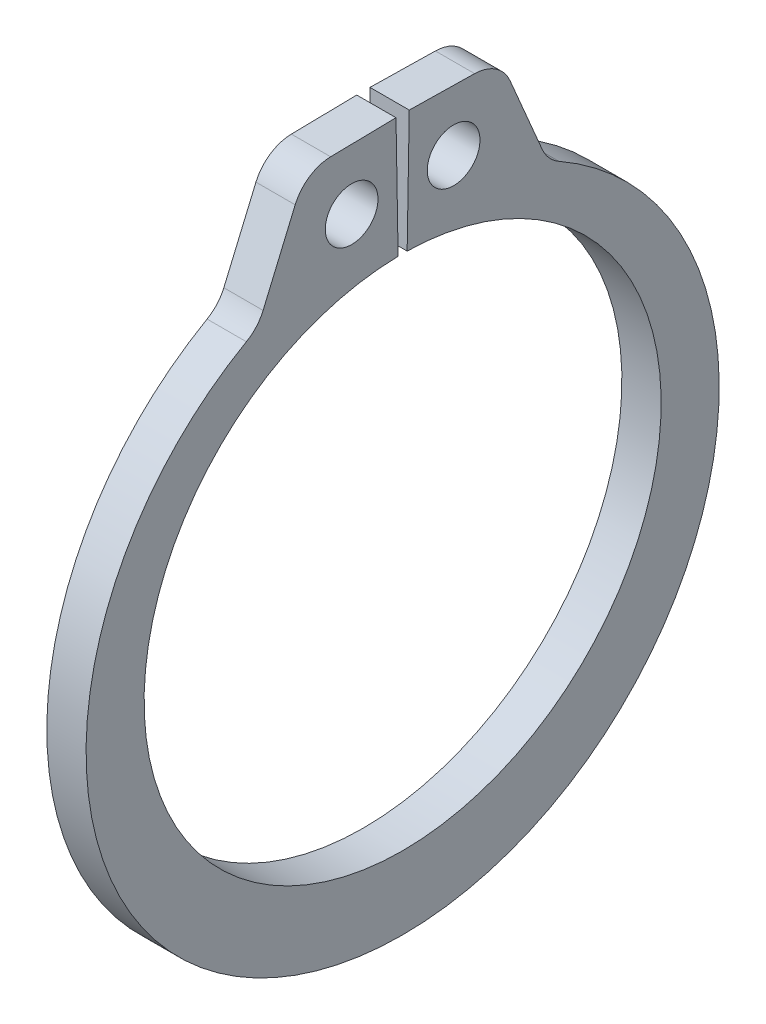
ISO-10303-21;
HEADER;
FILE_DESCRIPTION(('STEP AP214'),'2;1');
FILE_NAME('part.step','',(''),(''),'','','');
FILE_SCHEMA(('AUTOMOTIVE_DESIGN { 1 0 10303 214 1 1 1 1 }'));
ENDSEC;
DATA;
#1=APPLICATION_CONTEXT('core data for automotive mechanical design processes');
#2=APPLICATION_PROTOCOL_DEFINITION('international standard','automotive_design',2000,#1);
#3=PRODUCT_CONTEXT('',#1,'mechanical');
#4=PRODUCT('Part','Part','',(#3));
#5=PRODUCT_RELATED_PRODUCT_CATEGORY('part','',(#4));
#6=PRODUCT_DEFINITION_FORMATION('','',#4);
#7=PRODUCT_DEFINITION_CONTEXT('part definition',#1,'design');
#8=PRODUCT_DEFINITION('design','',#6,#7);
#9=PRODUCT_DEFINITION_SHAPE('','',#8);
#10=(LENGTH_UNIT() NAMED_UNIT(*) SI_UNIT(.MILLI.,.METRE.));
#11=(NAMED_UNIT(*) PLANE_ANGLE_UNIT() SI_UNIT($,.RADIAN.));
#12=(NAMED_UNIT(*) SI_UNIT($,.STERADIAN.) SOLID_ANGLE_UNIT());
#13=UNCERTAINTY_MEASURE_WITH_UNIT(LENGTH_MEASURE(1.E-05),#10,'distance_accuracy_value','');
#14=(GEOMETRIC_REPRESENTATION_CONTEXT(3) GLOBAL_UNCERTAINTY_ASSIGNED_CONTEXT((#13)) GLOBAL_UNIT_ASSIGNED_CONTEXT((#10,
#11,#12)) REPRESENTATION_CONTEXT('',''));
#15=CARTESIAN_POINT('',(0.,0.,0.));
#16=DIRECTION('',(0.,0.,1.));
#17=DIRECTION('',(1.,0.,0.));
#18=AXIS2_PLACEMENT_3D('',#15,#16,#17);
#19=CARTESIAN_POINT('',(0.4445,0.,0.));
#20=DIRECTION('',(1.,0.,0.));
#21=DIRECTION('',(0.,0.,-1.));
#22=AXIS2_PLACEMENT_3D('',#19,#20,#21);
#23=PLANE('',#22);
#24=CARTESIAN_POINT('',(0.4445,7.20724610900659,-1.15465964864512));
#25=DIRECTION('',(-1.,0.,0.));
#26=DIRECTION('',(0.,0.,1.));
#27=AXIS2_PLACEMENT_3D('',#24,#25,#26);
#28=CIRCLE('',#27,0.5969);
#29=CARTESIAN_POINT('',(0.4445,7.20724610900659,-0.557759648645121));
#30=VERTEX_POINT('',#29);
#31=EDGE_CURVE('E105',#30,#30,#28,.T.);
#32=ORIENTED_EDGE('',*,*,#31,.T.);
#33=EDGE_LOOP('',(#32));
#34=FACE_BOUND('',#33,.T.);
#35=CARTESIAN_POINT('',(0.4445,0.,0.));
#36=DIRECTION('',(-1.,0.,0.));
#37=DIRECTION('',(0.,0.,1.));
#38=AXIS2_PLACEMENT_3D('',#35,#36,#37);
#39=CIRCLE('',#38,5.8547);
#40=CARTESIAN_POINT('',(0.4445,5.85380830083212,-0.102178603968365));
#41=VERTEX_POINT('',#40);
#42=CARTESIAN_POINT('',(0.4445,5.85380830083212,0.102178603968364));
#43=VERTEX_POINT('',#42);
#44=EDGE_CURVE('E163',#41,#43,#39,.T.);
#45=ORIENTED_EDGE('',*,*,#44,.T.);
#46=DIRECTION('',(0.,-0.999847695156391,-0.0174524064372836));
#47=VECTOR('',#46,1.);
#48=CARTESIAN_POINT('',(0.4445,5.85380830083212,0.102178603968364));
#49=LINE('',#48,#47);
#50=CARTESIAN_POINT('',(0.4445,8.59659049818514,0.150054045307121));
#51=VERTEX_POINT('',#50);
#52=EDGE_CURVE('E119',#43,#51,#49,.F.);
#53=ORIENTED_EDGE('',*,*,#52,.T.);
#54=DIRECTION('',(0.,0.0174524064372841,-0.999847695156391));
#55=VECTOR('',#54,1.);
#56=CARTESIAN_POINT('',(0.4445,8.59659049818514,0.150054045307121));
#57=LINE('',#56,#55);
#58=CARTESIAN_POINT('',(0.4445,8.57074959100772,1.63047862600547));
#59=VERTEX_POINT('',#58);
#60=EDGE_CURVE('E116',#51,#59,#57,.F.);
#61=ORIENTED_EDGE('',*,*,#60,.T.);
#62=CARTESIAN_POINT('',(0.4445,7.68188499001369,1.61496343668273));
#63=DIRECTION('',(-1.,0.,0.));
#64=DIRECTION('',(0.,0.,1.));
#65=AXIS2_PLACEMENT_3D('',#62,#63,#64);
#66=CIRCLE('',#65,0.889);
#67=CARTESIAN_POINT('',(0.4445,8.02998759243226,2.43297662617873));
#68=VERTEX_POINT('',#67);
#69=EDGE_CURVE('E109',#68,#59,#66,.T.);
#70=ORIENTED_EDGE('',*,*,#69,.F.);
#71=DIRECTION('',(0.,0.920149819455567,-0.391566481910655));
#72=VECTOR('',#71,1.);
#73=CARTESIAN_POINT('',(0.4445,8.56068391718107,2.20714069332188));
#74=LINE('',#73,#72);
#75=CARTESIAN_POINT('',(0.4445,6.32221463110736,3.15971333386378));
#76=VERTEX_POINT('',#75);
#77=EDGE_CURVE('E104',#68,#76,#74,.F.);
#78=ORIENTED_EDGE('',*,*,#77,.T.);
#79=CARTESIAN_POINT('',(0.4445,6.67031723352593,3.97772652335978));
#80=DIRECTION('',(-1.,0.,0.));
#81=DIRECTION('',(0.,0.,1.));
#82=AXIS2_PLACEMENT_3D('',#79,#80,#81);
#83=CIRCLE('',#82,0.889);
#84=CARTESIAN_POINT('',(0.4445,5.89719335877508,3.53886381784672));
#85=VERTEX_POINT('',#84);
#86=EDGE_CURVE('E95',#76,#85,#83,.T.);
#87=ORIENTED_EDGE('',*,*,#86,.T.);
#88=CARTESIAN_POINT('',(0.4445,-0.337057291142251,0.));
#89=DIRECTION('',(-1.,0.,0.));
#90=DIRECTION('',(0.,0.,1.));
#91=AXIS2_PLACEMENT_3D('',#88,#89,#90);
#92=CIRCLE('',#91,7.16864270885775);
#93=CARTESIAN_POINT('',(0.4445,5.89719335877508,-3.53886381784672));
#94=VERTEX_POINT('',#93);
#95=EDGE_CURVE('E170',#94,#85,#92,.T.);
#96=ORIENTED_EDGE('',*,*,#95,.F.);
#97=CARTESIAN_POINT('',(0.4445,6.67031723352593,-3.97772652335978));
#98=DIRECTION('',(-1.,0.,0.));
#99=DIRECTION('',(0.,0.,1.));
#100=AXIS2_PLACEMENT_3D('',#97,#98,#99);
#101=CIRCLE('',#100,0.889);
#102=CARTESIAN_POINT('',(0.4445,6.32221463110736,-3.15971333386378));
#103=VERTEX_POINT('',#102);
#104=EDGE_CURVE('E167',#94,#103,#101,.T.);
#105=ORIENTED_EDGE('',*,*,#104,.T.);
#106=DIRECTION('',(0.,-0.920149819455567,-0.391566481910655));
#107=VECTOR('',#106,1.);
#108=CARTESIAN_POINT('',(0.4445,8.56068391718107,-2.20714069332188));
#109=LINE('',#108,#107);
#110=CARTESIAN_POINT('',(0.4445,8.02998759243226,-2.43297662617873));
#111=VERTEX_POINT('',#110);
#112=EDGE_CURVE('E132',#103,#111,#109,.F.);
#113=ORIENTED_EDGE('',*,*,#112,.T.);
#114=CARTESIAN_POINT('',(0.4445,7.68188499001369,-1.61496343668273));
#115=DIRECTION('',(-1.,0.,0.));
#116=DIRECTION('',(0.,0.,1.));
#117=AXIS2_PLACEMENT_3D('',#114,#115,#116);
#118=CIRCLE('',#117,0.889);
#119=CARTESIAN_POINT('',(0.4445,8.57074959100772,-1.63047862600547));
#120=VERTEX_POINT('',#119);
#121=EDGE_CURVE('E134',#120,#111,#118,.T.);
#122=ORIENTED_EDGE('',*,*,#121,.F.);
#123=DIRECTION('',(0.,-0.0174524064372841,-0.999847695156391));
#124=VECTOR('',#123,1.);
#125=CARTESIAN_POINT('',(0.4445,8.59659049818514,-0.150054045307121));
#126=LINE('',#125,#124);
#127=CARTESIAN_POINT('',(0.4445,8.59659049818514,-0.150054045307121));
#128=VERTEX_POINT('',#127);
#129=EDGE_CURVE('E128',#120,#128,#126,.F.);
#130=ORIENTED_EDGE('',*,*,#129,.T.);
#131=DIRECTION('',(0.,0.999847695156391,-0.0174524064372836));
#132=VECTOR('',#131,1.);
#133=CARTESIAN_POINT('',(0.4445,5.85380830083212,-0.102178603968364));
#134=LINE('',#133,#132);
#135=EDGE_CURVE('E123',#128,#41,#134,.F.);
#136=ORIENTED_EDGE('',*,*,#135,.T.);
#137=EDGE_LOOP('',(#45,#53,#61,#70,#78,#87,#96,#105,#113,#122,#130,#136));
#138=FACE_BOUND('',#137,.T.);
#139=CARTESIAN_POINT('',(0.4445,7.20724610900659,1.15465964864512));
#140=DIRECTION('',(-1.,0.,0.));
#141=DIRECTION('',(0.,0.,1.));
#142=AXIS2_PLACEMENT_3D('',#139,#140,#141);
#143=CIRCLE('',#142,0.5969);
#144=CARTESIAN_POINT('',(0.4445,7.20724610900659,1.75155964864512));
#145=VERTEX_POINT('',#144);
#146=EDGE_CURVE('E17',#145,#145,#143,.T.);
#147=ORIENTED_EDGE('',*,*,#146,.T.);
#148=EDGE_LOOP('',(#147));
#149=FACE_BOUND('',#148,.T.);
#150=ADVANCED_FACE('F14',(#34,#138,#149),#23,.T.);
#151=CARTESIAN_POINT('',(0.4445,7.20724610900659,1.15465964864512));
#152=DIRECTION('',(-1.,0.,0.));
#153=DIRECTION('',(0.,0.,1.));
#154=AXIS2_PLACEMENT_3D('',#151,#152,#153);
#155=CYLINDRICAL_SURFACE('',#154,0.5969);
#156=CARTESIAN_POINT('',(-0.4445,7.20724610900659,1.15465964864512));
#157=DIRECTION('',(-1.,0.,0.));
#158=DIRECTION('',(0.,0.,1.));
#159=AXIS2_PLACEMENT_3D('',#156,#157,#158);
#160=CIRCLE('',#159,0.5969);
#161=CARTESIAN_POINT('',(-0.4445,7.20724610900659,1.75155964864512));
#162=VERTEX_POINT('',#161);
#163=EDGE_CURVE('E157',#162,#162,#160,.T.);
#164=ORIENTED_EDGE('',*,*,#163,.T.);
#165=EDGE_LOOP('',(#164));
#166=FACE_BOUND('',#165,.T.);
#167=ORIENTED_EDGE('',*,*,#146,.F.);
#168=EDGE_LOOP('',(#167));
#169=FACE_BOUND('',#168,.T.);
#170=ADVANCED_FACE('F365',(#166,#169),#155,.F.);
#171=CARTESIAN_POINT('',(0.4445,6.67031723352593,3.97772652335978));
#172=DIRECTION('',(-1.,0.,0.));
#173=DIRECTION('',(0.,0.,1.));
#174=AXIS2_PLACEMENT_3D('',#171,#172,#173);
#175=CYLINDRICAL_SURFACE('',#174,0.889);
#176=DIRECTION('',(1.,0.,0.));
#177=VECTOR('',#176,1.);
#178=CARTESIAN_POINT('',(0.4445,6.32221463110736,3.15971333386378));
#179=LINE('',#178,#177);
#180=CARTESIAN_POINT('',(-0.4445,6.32221463110736,3.15971333386378));
#181=VERTEX_POINT('',#180);
#182=EDGE_CURVE('E99',#76,#181,#179,.F.);
#183=ORIENTED_EDGE('',*,*,#182,.T.);
#184=CARTESIAN_POINT('',(-0.4445,6.67031723352593,3.97772652335978));
#185=DIRECTION('',(-1.,0.,0.));
#186=DIRECTION('',(0.,0.,1.));
#187=AXIS2_PLACEMENT_3D('',#184,#185,#186);
#188=CIRCLE('',#187,0.889);
#189=CARTESIAN_POINT('',(-0.4445,5.89719335877508,3.53886381784672));
#190=VERTEX_POINT('',#189);
#191=EDGE_CURVE('E155',#181,#190,#188,.T.);
#192=ORIENTED_EDGE('',*,*,#191,.T.);
#193=DIRECTION('',(-1.,0.,0.));
#194=VECTOR('',#193,1.);
#195=CARTESIAN_POINT('',(0.4445,5.89719335877508,3.53886381784672));
#196=LINE('',#195,#194);
#197=EDGE_CURVE('E100',#85,#190,#196,.T.);
#198=ORIENTED_EDGE('',*,*,#197,.F.);
#199=ORIENTED_EDGE('',*,*,#86,.F.);
#200=EDGE_LOOP('',(#183,#192,#198,#199));
#201=FACE_BOUND('',#200,.T.);
#202=ADVANCED_FACE('F97',(#201),#175,.F.);
#203=CARTESIAN_POINT('',(0.4445,-0.337057291142251,0.));
#204=DIRECTION('',(-1.,0.,0.));
#205=DIRECTION('',(0.,0.,1.));
#206=AXIS2_PLACEMENT_3D('',#203,#204,#205);
#207=CYLINDRICAL_SURFACE('',#206,7.16864270885775);
#208=CARTESIAN_POINT('',(-0.4445,-0.337057291142251,0.));
#209=DIRECTION('',(-1.,0.,0.));
#210=DIRECTION('',(0.,0.,1.));
#211=AXIS2_PLACEMENT_3D('',#208,#209,#210);
#212=CIRCLE('',#211,7.16864270885775);
#213=CARTESIAN_POINT('',(-0.4445,5.89719335877508,-3.53886381784672));
#214=VERTEX_POINT('',#213);
#215=EDGE_CURVE('E153',#190,#214,#212,.F.);
#216=ORIENTED_EDGE('',*,*,#215,.T.);
#217=DIRECTION('',(-1.,0.,0.));
#218=VECTOR('',#217,1.);
#219=CARTESIAN_POINT('',(0.4445,5.89719335877508,-3.53886381784672));
#220=LINE('',#219,#218);
#221=EDGE_CURVE('E169',#214,#94,#220,.F.);
#222=ORIENTED_EDGE('',*,*,#221,.T.);
#223=ORIENTED_EDGE('',*,*,#95,.T.);
#224=ORIENTED_EDGE('',*,*,#197,.T.);
#225=EDGE_LOOP('',(#216,#222,#223,#224));
#226=FACE_BOUND('',#225,.T.);
#227=ADVANCED_FACE('F175',(#226),#207,.T.);
#228=CARTESIAN_POINT('',(0.4445,6.67031723352593,-3.97772652335978));
#229=DIRECTION('',(-1.,0.,0.));
#230=DIRECTION('',(0.,0.,1.));
#231=AXIS2_PLACEMENT_3D('',#228,#229,#230);
#232=CYLINDRICAL_SURFACE('',#231,0.889);
#233=ORIENTED_EDGE('',*,*,#221,.F.);
#234=CARTESIAN_POINT('',(-0.4445,6.67031723352593,-3.97772652335978));
#235=DIRECTION('',(-1.,0.,0.));
#236=DIRECTION('',(0.,0.,1.));
#237=AXIS2_PLACEMENT_3D('',#234,#235,#236);
#238=CIRCLE('',#237,0.889);
#239=CARTESIAN_POINT('',(-0.4445,6.32221463110736,-3.15971333386378));
#240=VERTEX_POINT('',#239);
#241=EDGE_CURVE('E150',#214,#240,#238,.T.);
#242=ORIENTED_EDGE('',*,*,#241,.T.);
#243=DIRECTION('',(1.,0.,0.));
#244=VECTOR('',#243,1.);
#245=CARTESIAN_POINT('',(0.4445,6.32221463110736,-3.15971333386378));
#246=LINE('',#245,#244);
#247=EDGE_CURVE('E135',#240,#103,#246,.T.);
#248=ORIENTED_EDGE('',*,*,#247,.T.);
#249=ORIENTED_EDGE('',*,*,#104,.F.);
#250=EDGE_LOOP('',(#233,#242,#248,#249));
#251=FACE_BOUND('',#250,.T.);
#252=ADVANCED_FACE('F187',(#251),#232,.F.);
#253=CARTESIAN_POINT('',(0.4445,8.56068391718107,-2.20714069332188));
#254=DIRECTION('',(0.,-0.391566481910655,0.920149819455567));
#255=DIRECTION('',(0.,-0.920149819455567,-0.391566481910655));
#256=AXIS2_PLACEMENT_3D('',#253,#254,#255);
#257=PLANE('',#256);
#258=ORIENTED_EDGE('',*,*,#247,.F.);
#259=DIRECTION('',(0.,0.920149819455567,0.391566481910655));
#260=VECTOR('',#259,1.);
#261=CARTESIAN_POINT('',(-0.4445,6.32221463110736,-3.15971333386378));
#262=LINE('',#261,#260);
#263=CARTESIAN_POINT('',(-0.4445,8.02998759243226,-2.43297662617873));
#264=VERTEX_POINT('',#263);
#265=EDGE_CURVE('E149',#240,#264,#262,.T.);
#266=ORIENTED_EDGE('',*,*,#265,.T.);
#267=DIRECTION('',(-1.,0.,0.));
#268=VECTOR('',#267,1.);
#269=CARTESIAN_POINT('',(0.4445,8.02998759243226,-2.43297662617873));
#270=LINE('',#269,#268);
#271=EDGE_CURVE('E166',#111,#264,#270,.T.);
#272=ORIENTED_EDGE('',*,*,#271,.F.);
#273=ORIENTED_EDGE('',*,*,#112,.F.);
#274=EDGE_LOOP('',(#258,#266,#272,#273));
#275=FACE_BOUND('',#274,.T.);
#276=ADVANCED_FACE('F192',(#275),#257,.F.);
#277=CARTESIAN_POINT('',(0.4445,7.68188499001369,-1.61496343668273));
#278=DIRECTION('',(-1.,0.,0.));
#279=DIRECTION('',(0.,0.,1.));
#280=AXIS2_PLACEMENT_3D('',#277,#278,#279);
#281=CYLINDRICAL_SURFACE('',#280,0.889);
#282=CARTESIAN_POINT('',(-0.4445,7.68188499001369,-1.61496343668273));
#283=DIRECTION('',(-1.,0.,0.));
#284=DIRECTION('',(0.,0.,1.));
#285=AXIS2_PLACEMENT_3D('',#282,#283,#284);
#286=CIRCLE('',#285,0.889);
#287=CARTESIAN_POINT('',(-0.4445,8.57074959100772,-1.63047862600547));
#288=VERTEX_POINT('',#287);
#289=EDGE_CURVE('E145',#264,#288,#286,.F.);
#290=ORIENTED_EDGE('',*,*,#289,.T.);
#291=DIRECTION('',(1.,0.,0.));
#292=VECTOR('',#291,1.);
#293=CARTESIAN_POINT('',(0.4445,8.57074959100772,-1.63047862600547));
#294=LINE('',#293,#292);
#295=EDGE_CURVE('E131',#288,#120,#294,.T.);
#296=ORIENTED_EDGE('',*,*,#295,.T.);
#297=ORIENTED_EDGE('',*,*,#121,.T.);
#298=ORIENTED_EDGE('',*,*,#271,.T.);
#299=EDGE_LOOP('',(#290,#296,#297,#298));
#300=FACE_BOUND('',#299,.T.);
#301=ADVANCED_FACE('F243',(#300),#281,.T.);
#302=CARTESIAN_POINT('',(0.4445,8.59659049818514,-0.150054045307121));
#303=DIRECTION('',(0.,-0.999847695156391,0.0174524064372841));
#304=DIRECTION('',(0.,-0.0174524064372841,-0.999847695156391));
#305=AXIS2_PLACEMENT_3D('',#302,#303,#304);
#306=PLANE('',#305);
#307=ORIENTED_EDGE('',*,*,#295,.F.);
#308=DIRECTION('',(0.,0.0174524064372836,0.999847695156391));
#309=VECTOR('',#308,1.);
#310=CARTESIAN_POINT('',(-0.4445,8.57074959100772,-1.63047862600547));
#311=LINE('',#310,#309);
#312=CARTESIAN_POINT('',(-0.4445,8.59659049818514,-0.150054045307121));
#313=VERTEX_POINT('',#312);
#314=EDGE_CURVE('E148',#288,#313,#311,.T.);
#315=ORIENTED_EDGE('',*,*,#314,.T.);
#316=DIRECTION('',(1.,0.,0.));
#317=VECTOR('',#316,1.);
#318=CARTESIAN_POINT('',(0.4445,8.59659049818514,-0.150054045307121));
#319=LINE('',#318,#317);
#320=EDGE_CURVE('E127',#313,#128,#319,.T.);
#321=ORIENTED_EDGE('',*,*,#320,.T.);
#322=ORIENTED_EDGE('',*,*,#129,.F.);
#323=EDGE_LOOP('',(#307,#315,#321,#322));
#324=FACE_BOUND('',#323,.T.);
#325=ADVANCED_FACE('F241',(#324),#306,.F.);
#326=CARTESIAN_POINT('',(0.4445,5.85380830083212,-0.102178603968364));
#327=DIRECTION('',(0.,-0.0174524064372836,-0.999847695156391));
#328=DIRECTION('',(0.,0.999847695156391,-0.0174524064372836));
#329=AXIS2_PLACEMENT_3D('',#326,#327,#328);
#330=PLANE('',#329);
#331=DIRECTION('',(-1.,0.,0.));
#332=VECTOR('',#331,1.);
#333=CARTESIAN_POINT('',(0.4445,5.85380830083212,-0.102178603968365));
#334=LINE('',#333,#332);
#335=CARTESIAN_POINT('',(-0.4445,5.85380830083212,-0.102178603968365));
#336=VERTEX_POINT('',#335);
#337=EDGE_CURVE('E126',#336,#41,#334,.F.);
#338=ORIENTED_EDGE('',*,*,#337,.T.);
#339=ORIENTED_EDGE('',*,*,#135,.F.);
#340=ORIENTED_EDGE('',*,*,#320,.F.);
#341=DIRECTION('',(0.,-0.999847695156391,0.0174524064372836));
#342=VECTOR('',#341,1.);
#343=CARTESIAN_POINT('',(-0.4445,8.59659049818514,-0.150054045307121));
#344=LINE('',#343,#342);
#345=EDGE_CURVE('E144',#313,#336,#344,.T.);
#346=ORIENTED_EDGE('',*,*,#345,.T.);
#347=EDGE_LOOP('',(#338,#339,#340,#346));
#348=FACE_BOUND('',#347,.T.);
#349=ADVANCED_FACE('F236',(#348),#330,.F.);
#350=CARTESIAN_POINT('',(0.4445,0.,0.));
#351=DIRECTION('',(-1.,0.,0.));
#352=DIRECTION('',(0.,0.,1.));
#353=AXIS2_PLACEMENT_3D('',#350,#351,#352);
#354=CYLINDRICAL_SURFACE('',#353,5.8547);
#355=ORIENTED_EDGE('',*,*,#44,.F.);
#356=ORIENTED_EDGE('',*,*,#337,.F.);
#357=CARTESIAN_POINT('',(-0.4445,0.,0.));
#358=DIRECTION('',(-1.,0.,0.));
#359=DIRECTION('',(0.,0.,1.));
#360=AXIS2_PLACEMENT_3D('',#357,#358,#359);
#361=CIRCLE('',#360,5.8547);
#362=CARTESIAN_POINT('',(-0.4445,5.85380830083212,0.102178603968364));
#363=VERTEX_POINT('',#362);
#364=EDGE_CURVE('E141',#336,#363,#361,.T.);
#365=ORIENTED_EDGE('',*,*,#364,.T.);
#366=DIRECTION('',(1.,0.,0.));
#367=VECTOR('',#366,1.);
#368=CARTESIAN_POINT('',(0.4445,5.85380830083212,0.102178603968364));
#369=LINE('',#368,#367);
#370=EDGE_CURVE('E122',#363,#43,#369,.T.);
#371=ORIENTED_EDGE('',*,*,#370,.T.);
#372=EDGE_LOOP('',(#355,#356,#365,#371));
#373=FACE_BOUND('',#372,.T.);
#374=ADVANCED_FACE('F231',(#373),#354,.F.);
#375=CARTESIAN_POINT('',(0.4445,5.85380830083212,0.102178603968364));
#376=DIRECTION('',(0.,-0.0174524064372836,0.999847695156391));
#377=DIRECTION('',(0.,-0.999847695156391,-0.0174524064372836));
#378=AXIS2_PLACEMENT_3D('',#375,#376,#377);
#379=PLANE('',#378);
#380=DIRECTION('',(1.,0.,0.));
#381=VECTOR('',#380,1.);
#382=CARTESIAN_POINT('',(0.4445,8.59659049818514,0.150054045307121));
#383=LINE('',#382,#381);
#384=CARTESIAN_POINT('',(-0.4445,8.59659049818514,0.150054045307121));
#385=VERTEX_POINT('',#384);
#386=EDGE_CURVE('E118',#385,#51,#383,.T.);
#387=ORIENTED_EDGE('',*,*,#386,.T.);
#388=ORIENTED_EDGE('',*,*,#52,.F.);
#389=ORIENTED_EDGE('',*,*,#370,.F.);
#390=DIRECTION('',(0.,0.999847695156391,0.0174524064372836));
#391=VECTOR('',#390,1.);
#392=CARTESIAN_POINT('',(-0.4445,5.85380830083212,0.102178603968364));
#393=LINE('',#392,#391);
#394=EDGE_CURVE('E143',#363,#385,#393,.T.);
#395=ORIENTED_EDGE('',*,*,#394,.T.);
#396=EDGE_LOOP('',(#387,#388,#389,#395));
#397=FACE_BOUND('',#396,.T.);
#398=ADVANCED_FACE('F228',(#397),#379,.F.);
#399=CARTESIAN_POINT('',(0.4445,8.59659049818514,0.150054045307121));
#400=DIRECTION('',(0.,-0.999847695156391,-0.0174524064372841));
#401=DIRECTION('',(0.,0.0174524064372841,-0.999847695156391));
#402=AXIS2_PLACEMENT_3D('',#399,#400,#401);
#403=PLANE('',#402);
#404=DIRECTION('',(-1.,0.,0.));
#405=VECTOR('',#404,1.);
#406=CARTESIAN_POINT('',(0.4445,8.57074959100772,1.63047862600547));
#407=LINE('',#406,#405);
#408=CARTESIAN_POINT('',(-0.4445,8.57074959100772,1.63047862600547));
#409=VERTEX_POINT('',#408);
#410=EDGE_CURVE('E111',#59,#409,#407,.T.);
#411=ORIENTED_EDGE('',*,*,#410,.F.);
#412=ORIENTED_EDGE('',*,*,#60,.F.);
#413=ORIENTED_EDGE('',*,*,#386,.F.);
#414=DIRECTION('',(0.,-0.0174524064372836,0.999847695156391));
#415=VECTOR('',#414,1.);
#416=CARTESIAN_POINT('',(-0.4445,8.59659049818514,0.150054045307121));
#417=LINE('',#416,#415);
#418=EDGE_CURVE('E140',#385,#409,#417,.T.);
#419=ORIENTED_EDGE('',*,*,#418,.T.);
#420=EDGE_LOOP('',(#411,#412,#413,#419));
#421=FACE_BOUND('',#420,.T.);
#422=ADVANCED_FACE('F221',(#421),#403,.F.);
#423=CARTESIAN_POINT('',(0.4445,7.68188499001369,1.61496343668273));
#424=DIRECTION('',(-1.,0.,0.));
#425=DIRECTION('',(0.,0.,1.));
#426=AXIS2_PLACEMENT_3D('',#423,#424,#425);
#427=CYLINDRICAL_SURFACE('',#426,0.889);
#428=CARTESIAN_POINT('',(-0.4445,7.68188499001369,1.61496343668273));
#429=DIRECTION('',(-1.,0.,0.));
#430=DIRECTION('',(0.,0.,1.));
#431=AXIS2_PLACEMENT_3D('',#428,#429,#430);
#432=CIRCLE('',#431,0.889);
#433=CARTESIAN_POINT('',(-0.4445,8.02998759243226,2.43297662617873));
#434=VERTEX_POINT('',#433);
#435=EDGE_CURVE('E137',#409,#434,#432,.F.);
#436=ORIENTED_EDGE('',*,*,#435,.T.);
#437=DIRECTION('',(1.,0.,0.));
#438=VECTOR('',#437,1.);
#439=CARTESIAN_POINT('',(0.4445,8.02998759243226,2.43297662617873));
#440=LINE('',#439,#438);
#441=EDGE_CURVE('E32',#434,#68,#440,.T.);
#442=ORIENTED_EDGE('',*,*,#441,.T.);
#443=ORIENTED_EDGE('',*,*,#69,.T.);
#444=ORIENTED_EDGE('',*,*,#410,.T.);
#445=EDGE_LOOP('',(#436,#442,#443,#444));
#446=FACE_BOUND('',#445,.T.);
#447=ADVANCED_FACE('F266',(#446),#427,.T.);
#448=CARTESIAN_POINT('',(0.4445,8.56068391718107,2.20714069332188));
#449=DIRECTION('',(0.,-0.391566481910655,-0.920149819455567));
#450=DIRECTION('',(0.,0.920149819455567,-0.391566481910655));
#451=AXIS2_PLACEMENT_3D('',#448,#449,#450);
#452=PLANE('',#451);
#453=ORIENTED_EDGE('',*,*,#182,.F.);
#454=ORIENTED_EDGE('',*,*,#77,.F.);
#455=ORIENTED_EDGE('',*,*,#441,.F.);
#456=DIRECTION('',(0.,-0.920149819455567,0.391566481910655));
#457=VECTOR('',#456,1.);
#458=CARTESIAN_POINT('',(-0.4445,8.02998759243226,2.43297662617873));
#459=LINE('',#458,#457);
#460=EDGE_CURVE('E23',#434,#181,#459,.T.);
#461=ORIENTED_EDGE('',*,*,#460,.T.);
#462=EDGE_LOOP('',(#453,#454,#455,#461));
#463=FACE_BOUND('',#462,.T.);
#464=ADVANCED_FACE('F103',(#463),#452,.F.);
#465=CARTESIAN_POINT('',(0.4445,7.20724610900659,-1.15465964864512));
#466=DIRECTION('',(-1.,0.,0.));
#467=DIRECTION('',(0.,0.,1.));
#468=AXIS2_PLACEMENT_3D('',#465,#466,#467);
#469=CYLINDRICAL_SURFACE('',#468,0.5969);
#470=CARTESIAN_POINT('',(-0.4445,7.20724610900659,-1.15465964864512));
#471=DIRECTION('',(-1.,0.,0.));
#472=DIRECTION('',(0.,0.,1.));
#473=AXIS2_PLACEMENT_3D('',#470,#471,#472);
#474=CIRCLE('',#473,0.5969);
#475=CARTESIAN_POINT('',(-0.4445,7.20724610900659,-0.557759648645121));
#476=VERTEX_POINT('',#475);
#477=EDGE_CURVE('E9',#476,#476,#474,.T.);
#478=ORIENTED_EDGE('',*,*,#477,.T.);
#479=EDGE_LOOP('',(#478));
#480=FACE_BOUND('',#479,.T.);
#481=ORIENTED_EDGE('',*,*,#31,.F.);
#482=EDGE_LOOP('',(#481));
#483=FACE_BOUND('',#482,.T.);
#484=ADVANCED_FACE('F254',(#480,#483),#469,.F.);
#485=CARTESIAN_POINT('',(-0.4445,0.,0.));
#486=DIRECTION('',(1.,0.,0.));
#487=DIRECTION('',(0.,0.,-1.));
#488=AXIS2_PLACEMENT_3D('',#485,#486,#487);
#489=PLANE('',#488);
#490=ORIENTED_EDGE('',*,*,#477,.F.);
#491=EDGE_LOOP('',(#490));
#492=FACE_BOUND('',#491,.T.);
#493=ORIENTED_EDGE('',*,*,#435,.F.);
#494=ORIENTED_EDGE('',*,*,#418,.F.);
#495=ORIENTED_EDGE('',*,*,#394,.F.);
#496=ORIENTED_EDGE('',*,*,#364,.F.);
#497=ORIENTED_EDGE('',*,*,#345,.F.);
#498=ORIENTED_EDGE('',*,*,#314,.F.);
#499=ORIENTED_EDGE('',*,*,#289,.F.);
#500=ORIENTED_EDGE('',*,*,#265,.F.);
#501=ORIENTED_EDGE('',*,*,#241,.F.);
#502=ORIENTED_EDGE('',*,*,#215,.F.);
#503=ORIENTED_EDGE('',*,*,#191,.F.);
#504=ORIENTED_EDGE('',*,*,#460,.F.);
#505=EDGE_LOOP('',(#493,#494,#495,#496,#497,#498,#499,#500,#501,#502,#503,#504));
#506=FACE_BOUND('',#505,.T.);
#507=ORIENTED_EDGE('',*,*,#163,.F.);
#508=EDGE_LOOP('',(#507));
#509=FACE_BOUND('',#508,.T.);
#510=ADVANCED_FACE('F180',(#492,#506,#509),#489,.F.);
#511=CLOSED_SHELL('',(#150,#170,#202,#227,#252,#276,#301,#325,#349,#374,#398,#422,#447,#464,
#484,#510));
#512=MANIFOLD_SOLID_BREP('B1',#511);
#513=ADVANCED_BREP_SHAPE_REPRESENTATION('',(#18,#512),#14);
#514=SHAPE_DEFINITION_REPRESENTATION(#9,#513);
ENDSEC;
END-ISO-10303-21;
